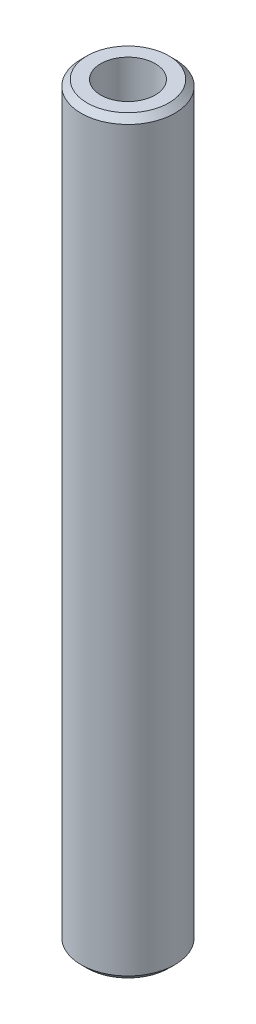
ISO-10303-21;
HEADER;
FILE_DESCRIPTION(('STEP AP214'),'2;1');
FILE_NAME('part.step','',(''),(''),'','','');
FILE_SCHEMA(('AUTOMOTIVE_DESIGN { 1 0 10303 214 1 1 1 1 }'));
ENDSEC;
DATA;
#1=APPLICATION_CONTEXT('core data for automotive mechanical design processes');
#2=APPLICATION_PROTOCOL_DEFINITION('international standard','automotive_design',2000,#1);
#3=PRODUCT_CONTEXT('',#1,'mechanical');
#4=PRODUCT('Part','Part','',(#3));
#5=PRODUCT_RELATED_PRODUCT_CATEGORY('part','',(#4));
#6=PRODUCT_DEFINITION_FORMATION('','',#4);
#7=PRODUCT_DEFINITION_CONTEXT('part definition',#1,'design');
#8=PRODUCT_DEFINITION('design','',#6,#7);
#9=PRODUCT_DEFINITION_SHAPE('','',#8);
#10=(LENGTH_UNIT() NAMED_UNIT(*) SI_UNIT(.MILLI.,.METRE.));
#11=(NAMED_UNIT(*) PLANE_ANGLE_UNIT() SI_UNIT($,.RADIAN.));
#12=(NAMED_UNIT(*) SI_UNIT($,.STERADIAN.) SOLID_ANGLE_UNIT());
#13=UNCERTAINTY_MEASURE_WITH_UNIT(LENGTH_MEASURE(1.E-05),#10,'distance_accuracy_value','');
#14=(GEOMETRIC_REPRESENTATION_CONTEXT(3) GLOBAL_UNCERTAINTY_ASSIGNED_CONTEXT((#13)) GLOBAL_UNIT_ASSIGNED_CONTEXT((#10,
#11,#12)) REPRESENTATION_CONTEXT('',''));
#15=CARTESIAN_POINT('',(0.,0.,0.));
#16=DIRECTION('',(0.,0.,1.));
#17=DIRECTION('',(1.,0.,0.));
#18=AXIS2_PLACEMENT_3D('',#15,#16,#17);
#19=CARTESIAN_POINT('',(0.,600.,0.));
#20=DIRECTION('',(0.,-1.,0.));
#21=DIRECTION('',(0.,0.,-1.));
#22=AXIS2_PLACEMENT_3D('',#19,#20,#21);
#23=CYLINDRICAL_SURFACE('',#22,37.5);
#24=CARTESIAN_POINT('',(0.,595.212865996906,0.));
#25=DIRECTION('',(0.,1.,0.));
#26=DIRECTION('',(0.,0.,1.));
#27=AXIS2_PLACEMENT_3D('',#24,#25,#26);
#28=CIRCLE('',#27,37.5);
#29=CARTESIAN_POINT('',(0.,595.212865996906,37.5));
#30=VERTEX_POINT('',#29);
#31=EDGE_CURVE('E50',#30,#30,#28,.F.);
#32=ORIENTED_EDGE('',*,*,#31,.T.);
#33=EDGE_LOOP('',(#32));
#34=FACE_BOUND('',#33,.T.);
#35=CARTESIAN_POINT('',(0.,4.78713400309438,0.));
#36=DIRECTION('',(0.,1.,0.));
#37=DIRECTION('',(0.,0.,1.));
#38=AXIS2_PLACEMENT_3D('',#35,#36,#37);
#39=CIRCLE('',#38,37.5);
#40=CARTESIAN_POINT('',(0.,4.78713400309438,37.5));
#41=VERTEX_POINT('',#40);
#42=EDGE_CURVE('E51',#41,#41,#39,.T.);
#43=ORIENTED_EDGE('',*,*,#42,.T.);
#44=EDGE_LOOP('',(#43));
#45=FACE_BOUND('',#44,.T.);
#46=ADVANCED_FACE('F39',(#34,#45),#23,.T.);
#47=CARTESIAN_POINT('',(0.,600.,0.));
#48=DIRECTION('',(0.,1.,0.));
#49=DIRECTION('',(0.,0.,1.));
#50=AXIS2_PLACEMENT_3D('',#47,#48,#49);
#51=PLANE('',#50);
#52=CARTESIAN_POINT('',(0.,600.,0.));
#53=DIRECTION('',(0.,1.,0.));
#54=DIRECTION('',(0.,0.,1.));
#55=AXIS2_PLACEMENT_3D('',#52,#53,#54);
#56=CIRCLE('',#55,32.7128659969056);
#57=CARTESIAN_POINT('',(0.,600.,32.7128659969056));
#58=VERTEX_POINT('',#57);
#59=EDGE_CURVE('E54',#58,#58,#56,.T.);
#60=ORIENTED_EDGE('',*,*,#59,.T.);
#61=EDGE_LOOP('',(#60));
#62=FACE_BOUND('',#61,.T.);
#63=CARTESIAN_POINT('',(0.,600.,0.));
#64=DIRECTION('',(0.,1.,0.));
#65=DIRECTION('',(0.,0.,1.));
#66=AXIS2_PLACEMENT_3D('',#63,#64,#65);
#67=CIRCLE('',#66,21.8061468313439);
#68=CARTESIAN_POINT('',(0.,600.,21.8061468313439));
#69=VERTEX_POINT('',#68);
#70=EDGE_CURVE('E58',#69,#69,#67,.T.);
#71=ORIENTED_EDGE('',*,*,#70,.F.);
#72=EDGE_LOOP('',(#71));
#73=FACE_BOUND('',#72,.T.);
#74=ADVANCED_FACE('F69',(#62,#73),#51,.T.);
#75=CARTESIAN_POINT('',(0.,0.,0.));
#76=DIRECTION('',(0.,1.,0.));
#77=DIRECTION('',(0.,0.,1.));
#78=AXIS2_PLACEMENT_3D('',#75,#76,#77);
#79=PLANE('',#78);
#80=CARTESIAN_POINT('',(0.,0.,0.));
#81=DIRECTION('',(0.,1.,0.));
#82=DIRECTION('',(0.,0.,1.));
#83=AXIS2_PLACEMENT_3D('',#80,#81,#82);
#84=CIRCLE('',#83,32.7128659969056);
#85=CARTESIAN_POINT('',(0.,0.,32.7128659969056));
#86=VERTEX_POINT('',#85);
#87=EDGE_CURVE('E10',#86,#86,#84,.F.);
#88=ORIENTED_EDGE('',*,*,#87,.T.);
#89=EDGE_LOOP('',(#88));
#90=FACE_BOUND('',#89,.T.);
#91=CARTESIAN_POINT('',(0.,0.,0.));
#92=DIRECTION('',(0.,1.,0.));
#93=DIRECTION('',(0.,0.,1.));
#94=AXIS2_PLACEMENT_3D('',#91,#92,#93);
#95=CIRCLE('',#94,21.8061468313439);
#96=CARTESIAN_POINT('',(0.,0.,21.8061468313439));
#97=VERTEX_POINT('',#96);
#98=EDGE_CURVE('E63',#97,#97,#95,.T.);
#99=ORIENTED_EDGE('',*,*,#98,.T.);
#100=EDGE_LOOP('',(#99));
#101=FACE_BOUND('',#100,.T.);
#102=ADVANCED_FACE('F75',(#90,#101),#79,.F.);
#103=CARTESIAN_POINT('',(0.,600.,0.));
#104=DIRECTION('',(0.,-1.,0.));
#105=DIRECTION('',(0.,0.,-1.));
#106=AXIS2_PLACEMENT_3D('',#103,#104,#105);
#107=CYLINDRICAL_SURFACE('',#106,21.8061468313439);
#108=ORIENTED_EDGE('',*,*,#70,.T.);
#109=EDGE_LOOP('',(#108));
#110=FACE_BOUND('',#109,.T.);
#111=ORIENTED_EDGE('',*,*,#98,.F.);
#112=EDGE_LOOP('',(#111));
#113=FACE_BOUND('',#112,.T.);
#114=ADVANCED_FACE('F70',(#110,#113),#107,.F.);
#115=CARTESIAN_POINT('',(0.,600.,0.));
#116=DIRECTION('',(0.,-1.,0.));
#117=DIRECTION('',(0.,0.,-1.));
#118=AXIS2_PLACEMENT_3D('',#115,#116,#117);
#119=CONICAL_SURFACE('',#118,32.7128659969056,0.78539816339744);
#120=ORIENTED_EDGE('',*,*,#31,.F.);
#121=EDGE_LOOP('',(#120));
#122=FACE_BOUND('',#121,.T.);
#123=ORIENTED_EDGE('',*,*,#59,.F.);
#124=EDGE_LOOP('',(#123));
#125=FACE_BOUND('',#124,.T.);
#126=ADVANCED_FACE('F81',(#122,#125),#119,.T.);
#127=CARTESIAN_POINT('',(0.,4.78713400309438,0.));
#128=DIRECTION('',(0.,1.,0.));
#129=DIRECTION('',(0.,0.,1.));
#130=AXIS2_PLACEMENT_3D('',#127,#128,#129);
#131=CONICAL_SURFACE('',#130,37.5,0.785398163397451);
#132=ORIENTED_EDGE('',*,*,#87,.F.);
#133=EDGE_LOOP('',(#132));
#134=FACE_BOUND('',#133,.T.);
#135=ORIENTED_EDGE('',*,*,#42,.F.);
#136=EDGE_LOOP('',(#135));
#137=FACE_BOUND('',#136,.T.);
#138=ADVANCED_FACE('F45',(#134,#137),#131,.T.);
#139=CLOSED_SHELL('',(#46,#74,#102,#114,#126,#138));
#140=MANIFOLD_SOLID_BREP('B2',#139);
#141=ADVANCED_BREP_SHAPE_REPRESENTATION('',(#18,#140),#14);
#142=SHAPE_DEFINITION_REPRESENTATION(#9,#141);
ENDSEC;
END-ISO-10303-21;
